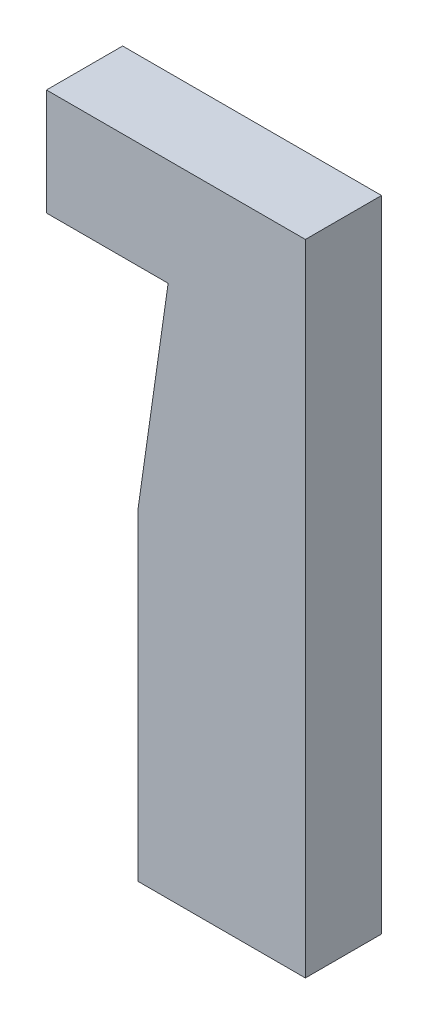
ISO-10303-21;
HEADER;
FILE_DESCRIPTION(('STEP AP214'),'2;1');
FILE_NAME('part.step','',(''),(''),'','','');
FILE_SCHEMA(('AUTOMOTIVE_DESIGN { 1 0 10303 214 1 1 1 1 }'));
ENDSEC;
DATA;
#1=APPLICATION_CONTEXT('core data for automotive mechanical design processes');
#2=APPLICATION_PROTOCOL_DEFINITION('international standard','automotive_design',2000,#1);
#3=PRODUCT_CONTEXT('',#1,'mechanical');
#4=PRODUCT('Part','Part','',(#3));
#5=PRODUCT_RELATED_PRODUCT_CATEGORY('part','',(#4));
#6=PRODUCT_DEFINITION_FORMATION('','',#4);
#7=PRODUCT_DEFINITION_CONTEXT('part definition',#1,'design');
#8=PRODUCT_DEFINITION('design','',#6,#7);
#9=PRODUCT_DEFINITION_SHAPE('','',#8);
#10=(LENGTH_UNIT() NAMED_UNIT(*) SI_UNIT(.MILLI.,.METRE.));
#11=(NAMED_UNIT(*) PLANE_ANGLE_UNIT() SI_UNIT($,.RADIAN.));
#12=(NAMED_UNIT(*) SI_UNIT($,.STERADIAN.) SOLID_ANGLE_UNIT());
#13=UNCERTAINTY_MEASURE_WITH_UNIT(LENGTH_MEASURE(1.E-05),#10,'distance_accuracy_value','');
#14=(GEOMETRIC_REPRESENTATION_CONTEXT(3) GLOBAL_UNCERTAINTY_ASSIGNED_CONTEXT((#13)) GLOBAL_UNIT_ASSIGNED_CONTEXT((#10,
#11,#12)) REPRESENTATION_CONTEXT('',''));
#15=CARTESIAN_POINT('',(0.,0.,0.));
#16=DIRECTION('',(0.,0.,1.));
#17=DIRECTION('',(1.,0.,0.));
#18=AXIS2_PLACEMENT_3D('',#15,#16,#17);
#19=CARTESIAN_POINT('',(0.,53.34,6.35));
#20=DIRECTION('',(0.,-1.,0.));
#21=DIRECTION('',(0.,0.,-1.));
#22=AXIS2_PLACEMENT_3D('',#19,#20,#21);
#23=PLANE('',#22);
#24=DIRECTION('',(-1.,0.,0.));
#25=VECTOR('',#24,1.);
#26=CARTESIAN_POINT('',(0.,53.34,0.));
#27=LINE('',#26,#25);
#28=CARTESIAN_POINT('',(0.,53.34,0.));
#29=VERTEX_POINT('',#28);
#30=CARTESIAN_POINT('',(-21.59,53.34,0.));
#31=VERTEX_POINT('',#30);
#32=EDGE_CURVE('E229',#29,#31,#27,.T.);
#33=ORIENTED_EDGE('',*,*,#32,.T.);
#34=DIRECTION('',(0.,0.,-1.));
#35=VECTOR('',#34,1.);
#36=CARTESIAN_POINT('',(-21.59,53.34,6.35));
#37=LINE('',#36,#35);
#38=CARTESIAN_POINT('',(-21.59,53.34,6.35));
#39=VERTEX_POINT('',#38);
#40=EDGE_CURVE('E281',#39,#31,#37,.T.);
#41=ORIENTED_EDGE('',*,*,#40,.F.);
#42=DIRECTION('',(-1.,0.,0.));
#43=VECTOR('',#42,1.);
#44=CARTESIAN_POINT('',(0.,53.34,6.35));
#45=LINE('',#44,#43);
#46=CARTESIAN_POINT('',(0.,53.34,6.35));
#47=VERTEX_POINT('',#46);
#48=EDGE_CURVE('E234',#47,#39,#45,.T.);
#49=ORIENTED_EDGE('',*,*,#48,.F.);
#50=DIRECTION('',(0.,0.,-1.));
#51=VECTOR('',#50,1.);
#52=CARTESIAN_POINT('',(0.,53.34,6.35));
#53=LINE('',#52,#51);
#54=EDGE_CURVE('E249',#47,#29,#53,.T.);
#55=ORIENTED_EDGE('',*,*,#54,.T.);
#56=EDGE_LOOP('',(#33,#41,#49,#55));
#57=FACE_BOUND('',#56,.T.);
#58=ADVANCED_FACE('F41',(#57),#23,.F.);
#59=CARTESIAN_POINT('',(-21.59,0.,6.35));
#60=DIRECTION('',(1.,0.,0.));
#61=DIRECTION('',(0.,0.,-1.));
#62=AXIS2_PLACEMENT_3D('',#59,#60,#61);
#63=PLANE('',#62);
#64=DIRECTION('',(0.,-1.,0.));
#65=VECTOR('',#64,1.);
#66=CARTESIAN_POINT('',(-21.59,0.,0.));
#67=LINE('',#66,#65);
#68=CARTESIAN_POINT('',(-21.59,44.45,0.));
#69=VERTEX_POINT('',#68);
#70=EDGE_CURVE('E253',#31,#69,#67,.T.);
#71=ORIENTED_EDGE('',*,*,#70,.T.);
#72=DIRECTION('',(0.,0.,-1.));
#73=VECTOR('',#72,1.);
#74=CARTESIAN_POINT('',(-21.59,44.45,6.35));
#75=LINE('',#74,#73);
#76=CARTESIAN_POINT('',(-21.59,44.45,6.35));
#77=VERTEX_POINT('',#76);
#78=EDGE_CURVE('E278',#77,#69,#75,.T.);
#79=ORIENTED_EDGE('',*,*,#78,.F.);
#80=DIRECTION('',(0.,-1.,0.));
#81=VECTOR('',#80,1.);
#82=CARTESIAN_POINT('',(-21.59,0.,6.35));
#83=LINE('',#82,#81);
#84=EDGE_CURVE('E156',#39,#77,#83,.T.);
#85=ORIENTED_EDGE('',*,*,#84,.F.);
#86=ORIENTED_EDGE('',*,*,#40,.T.);
#87=EDGE_LOOP('',(#71,#79,#85,#86));
#88=FACE_BOUND('',#87,.T.);
#89=ADVANCED_FACE('F346',(#88),#63,.F.);
#90=CARTESIAN_POINT('',(0.,44.45,6.35));
#91=DIRECTION('',(0.,-1.,0.));
#92=DIRECTION('',(0.,0.,-1.));
#93=AXIS2_PLACEMENT_3D('',#90,#91,#92);
#94=PLANE('',#93);
#95=DIRECTION('',(-1.,0.,0.));
#96=VECTOR('',#95,1.);
#97=CARTESIAN_POINT('',(0.,44.45,0.));
#98=LINE('',#97,#96);
#99=CARTESIAN_POINT('',(-11.4443077795451,44.45,0.));
#100=VERTEX_POINT('',#99);
#101=EDGE_CURVE('E166',#100,#69,#98,.T.);
#102=ORIENTED_EDGE('',*,*,#101,.F.);
#103=DIRECTION('',(0.,0.,-1.));
#104=VECTOR('',#103,1.);
#105=CARTESIAN_POINT('',(-11.4443077795451,44.45,6.35));
#106=LINE('',#105,#104);
#107=CARTESIAN_POINT('',(-11.4443077795451,44.45,6.35));
#108=VERTEX_POINT('',#107);
#109=EDGE_CURVE('E163',#108,#100,#106,.T.);
#110=ORIENTED_EDGE('',*,*,#109,.F.);
#111=DIRECTION('',(-1.,0.,0.));
#112=VECTOR('',#111,1.);
#113=CARTESIAN_POINT('',(0.,44.45,6.35));
#114=LINE('',#113,#112);
#115=EDGE_CURVE('E148',#108,#77,#114,.T.);
#116=ORIENTED_EDGE('',*,*,#115,.T.);
#117=ORIENTED_EDGE('',*,*,#78,.T.);
#118=EDGE_LOOP('',(#102,#110,#116,#117));
#119=FACE_BOUND('',#118,.T.);
#120=ADVANCED_FACE('F164',(#119),#94,.T.);
#121=CARTESIAN_POINT('',(-13.97,0.,6.35));
#122=DIRECTION('',(-1.,0.,0.));
#123=DIRECTION('',(0.,0.,1.));
#124=AXIS2_PLACEMENT_3D('',#121,#122,#123);
#125=PLANE('',#124);
#126=DIRECTION('',(0.,0.,-1.));
#127=VECTOR('',#126,1.);
#128=CARTESIAN_POINT('',(-13.97,26.7917452086647,6.35));
#129=LINE('',#128,#127);
#130=CARTESIAN_POINT('',(-13.97,26.7917452086647,6.35));
#131=VERTEX_POINT('',#130);
#132=CARTESIAN_POINT('',(-13.97,26.7917452086647,0.));
#133=VERTEX_POINT('',#132);
#134=EDGE_CURVE('E170',#131,#133,#129,.T.);
#135=ORIENTED_EDGE('',*,*,#134,.T.);
#136=DIRECTION('',(0.,1.,0.));
#137=VECTOR('',#136,1.);
#138=CARTESIAN_POINT('',(-13.97,0.,0.));
#139=LINE('',#138,#137);
#140=CARTESIAN_POINT('',(-13.97,0.,0.));
#141=VERTEX_POINT('',#140);
#142=EDGE_CURVE('E259',#141,#133,#139,.T.);
#143=ORIENTED_EDGE('',*,*,#142,.F.);
#144=DIRECTION('',(0.,0.,-1.));
#145=VECTOR('',#144,1.);
#146=CARTESIAN_POINT('',(-13.97,0.,6.35));
#147=LINE('',#146,#145);
#148=CARTESIAN_POINT('',(-13.97,0.,6.35));
#149=VERTEX_POINT('',#148);
#150=EDGE_CURVE('E275',#149,#141,#147,.T.);
#151=ORIENTED_EDGE('',*,*,#150,.F.);
#152=DIRECTION('',(0.,1.,0.));
#153=VECTOR('',#152,1.);
#154=CARTESIAN_POINT('',(-13.97,0.,6.35));
#155=LINE('',#154,#153);
#156=EDGE_CURVE('E160',#149,#131,#155,.T.);
#157=ORIENTED_EDGE('',*,*,#156,.T.);
#158=EDGE_LOOP('',(#135,#143,#151,#157));
#159=FACE_BOUND('',#158,.T.);
#160=ADVANCED_FACE('F366',(#159),#125,.T.);
#161=CARTESIAN_POINT('',(0.,0.,6.35));
#162=DIRECTION('',(0.,-1.,0.));
#163=DIRECTION('',(1.,0.,0.));
#164=AXIS2_PLACEMENT_3D('',#161,#162,#163);
#165=PLANE('',#164);
#166=DIRECTION('',(-1.,0.,0.));
#167=VECTOR('',#166,1.);
#168=CARTESIAN_POINT('',(0.,0.,0.));
#169=LINE('',#168,#167);
#170=CARTESIAN_POINT('',(0.,0.,0.));
#171=VERTEX_POINT('',#170);
#172=EDGE_CURVE('E263',#171,#141,#169,.T.);
#173=ORIENTED_EDGE('',*,*,#172,.F.);
#174=DIRECTION('',(0.,0.,-1.));
#175=VECTOR('',#174,1.);
#176=CARTESIAN_POINT('',(0.,0.,6.35));
#177=LINE('',#176,#175);
#178=CARTESIAN_POINT('',(0.,0.,6.35));
#179=VERTEX_POINT('',#178);
#180=EDGE_CURVE('E272',#179,#171,#177,.T.);
#181=ORIENTED_EDGE('',*,*,#180,.F.);
#182=DIRECTION('',(-1.,0.,0.));
#183=VECTOR('',#182,1.);
#184=CARTESIAN_POINT('',(0.,0.,6.35));
#185=LINE('',#184,#183);
#186=EDGE_CURVE('E242',#179,#149,#185,.T.);
#187=ORIENTED_EDGE('',*,*,#186,.T.);
#188=ORIENTED_EDGE('',*,*,#150,.T.);
#189=EDGE_LOOP('',(#173,#181,#187,#188));
#190=FACE_BOUND('',#189,.T.);
#191=ADVANCED_FACE('F363',(#190),#165,.T.);
#192=CARTESIAN_POINT('',(0.,0.,6.35));
#193=DIRECTION('',(-1.,0.,0.));
#194=DIRECTION('',(0.,-1.,0.));
#195=AXIS2_PLACEMENT_3D('',#192,#193,#194);
#196=PLANE('',#195);
#197=DIRECTION('',(0.,1.,0.));
#198=VECTOR('',#197,1.);
#199=CARTESIAN_POINT('',(0.,0.,0.));
#200=LINE('',#199,#198);
#201=EDGE_CURVE('E237',#171,#29,#200,.T.);
#202=ORIENTED_EDGE('',*,*,#201,.T.);
#203=ORIENTED_EDGE('',*,*,#54,.F.);
#204=DIRECTION('',(0.,1.,0.));
#205=VECTOR('',#204,1.);
#206=CARTESIAN_POINT('',(0.,0.,6.35));
#207=LINE('',#206,#205);
#208=EDGE_CURVE('E246',#179,#47,#207,.T.);
#209=ORIENTED_EDGE('',*,*,#208,.F.);
#210=ORIENTED_EDGE('',*,*,#180,.T.);
#211=EDGE_LOOP('',(#202,#203,#209,#210));
#212=FACE_BOUND('',#211,.T.);
#213=ADVANCED_FACE('F361',(#212),#196,.F.);
#214=CARTESIAN_POINT('',(0.,0.,6.35));
#215=DIRECTION('',(0.,0.,1.));
#216=DIRECTION('',(1.,0.,0.));
#217=AXIS2_PLACEMENT_3D('',#214,#215,#216);
#218=PLANE('',#217);
#219=DIRECTION('',(-0.141590807622745,-0.989925271521411,0.));
#220=VECTOR('',#219,1.);
#221=CARTESIAN_POINT('',(-11.4443077795451,44.45,6.35));
#222=LINE('',#221,#220);
#223=EDGE_CURVE('E153',#108,#131,#222,.T.);
#224=ORIENTED_EDGE('',*,*,#223,.T.);
#225=ORIENTED_EDGE('',*,*,#156,.F.);
#226=ORIENTED_EDGE('',*,*,#186,.F.);
#227=ORIENTED_EDGE('',*,*,#208,.T.);
#228=ORIENTED_EDGE('',*,*,#48,.T.);
#229=ORIENTED_EDGE('',*,*,#84,.T.);
#230=ORIENTED_EDGE('',*,*,#115,.F.);
#231=EDGE_LOOP('',(#224,#225,#226,#227,#228,#229,#230));
#232=FACE_BOUND('',#231,.T.);
#233=ADVANCED_FACE('F150',(#232),#218,.T.);
#234=CARTESIAN_POINT('',(0.,0.,0.));
#235=DIRECTION('',(0.,0.,1.));
#236=DIRECTION('',(1.,0.,0.));
#237=AXIS2_PLACEMENT_3D('',#234,#235,#236);
#238=PLANE('',#237);
#239=CARTESIAN_POINT('',(-6.985,15.24,0.));
#240=DIRECTION('',(0.,0.,-1.));
#241=DIRECTION('',(-1.,0.,0.));
#242=AXIS2_PLACEMENT_3D('',#239,#240,#241);
#243=CIRCLE('',#242,4.0005);
#244=CARTESIAN_POINT('',(-9.017,11.7939912579914,0.));
#245=VERTEX_POINT('',#244);
#246=CARTESIAN_POINT('',(-9.017,18.6860087420086,0.));
#247=VERTEX_POINT('',#246);
#248=EDGE_CURVE('E214',#245,#247,#243,.T.);
#249=ORIENTED_EDGE('',*,*,#248,.F.);
#250=DIRECTION('',(0.,1.,0.));
#251=VECTOR('',#250,1.);
#252=CARTESIAN_POINT('',(-9.017,15.24,0.));
#253=LINE('',#252,#251);
#254=CARTESIAN_POINT('',(-9.017,0.762000000000001,0.));
#255=VERTEX_POINT('',#254);
#256=EDGE_CURVE('E208',#255,#245,#253,.T.);
#257=ORIENTED_EDGE('',*,*,#256,.F.);
#258=DIRECTION('',(-1.,0.,0.));
#259=VECTOR('',#258,1.);
#260=CARTESIAN_POINT('',(-4.953,0.762000000000001,0.));
#261=LINE('',#260,#259);
#262=CARTESIAN_POINT('',(-4.953,0.762000000000001,0.));
#263=VERTEX_POINT('',#262);
#264=EDGE_CURVE('E203',#263,#255,#261,.T.);
#265=ORIENTED_EDGE('',*,*,#264,.F.);
#266=DIRECTION('',(0.,-1.,0.));
#267=VECTOR('',#266,1.);
#268=CARTESIAN_POINT('',(-4.953,15.24,0.));
#269=LINE('',#268,#267);
#270=CARTESIAN_POINT('',(-4.953,11.7939912579913,0.));
#271=VERTEX_POINT('',#270);
#272=EDGE_CURVE('E199',#271,#263,#269,.T.);
#273=ORIENTED_EDGE('',*,*,#272,.F.);
#274=CARTESIAN_POINT('',(-4.953,18.6860087420086,0.));
#275=VERTEX_POINT('',#274);
#276=EDGE_CURVE('E230',#275,#271,#243,.T.);
#277=ORIENTED_EDGE('',*,*,#276,.F.);
#278=CARTESIAN_POINT('',(-4.953,29.718,0.));
#279=VERTEX_POINT('',#278);
#280=EDGE_CURVE('E200',#279,#275,#269,.T.);
#281=ORIENTED_EDGE('',*,*,#280,.F.);
#282=DIRECTION('',(1.,0.,0.));
#283=VECTOR('',#282,1.);
#284=CARTESIAN_POINT('',(-6.985,29.718,0.));
#285=LINE('',#284,#283);
#286=CARTESIAN_POINT('',(-9.017,29.718,0.));
#287=VERTEX_POINT('',#286);
#288=EDGE_CURVE('E181',#287,#279,#285,.T.);
#289=ORIENTED_EDGE('',*,*,#288,.F.);
#290=EDGE_CURVE('E207',#247,#287,#253,.T.);
#291=ORIENTED_EDGE('',*,*,#290,.F.);
#292=EDGE_LOOP('',(#249,#257,#265,#273,#277,#281,#289,#291));
#293=FACE_BOUND('',#292,.T.);
#294=ORIENTED_EDGE('',*,*,#142,.T.);
#295=DIRECTION('',(-0.141590807622745,-0.989925271521411,0.));
#296=VECTOR('',#295,1.);
#297=CARTESIAN_POINT('',(-11.4443077795451,44.45,0.));
#298=LINE('',#297,#296);
#299=EDGE_CURVE('E175',#100,#133,#298,.T.);
#300=ORIENTED_EDGE('',*,*,#299,.F.);
#301=ORIENTED_EDGE('',*,*,#101,.T.);
#302=ORIENTED_EDGE('',*,*,#70,.F.);
#303=ORIENTED_EDGE('',*,*,#32,.F.);
#304=ORIENTED_EDGE('',*,*,#201,.F.);
#305=ORIENTED_EDGE('',*,*,#172,.T.);
#306=EDGE_LOOP('',(#294,#300,#301,#302,#303,#304,#305));
#307=FACE_BOUND('',#306,.T.);
#308=ADVANCED_FACE('F324',(#293,#307),#238,.F.);
#309=CARTESIAN_POINT('',(-6.985,15.24,2.794));
#310=DIRECTION('',(0.,0.,-1.));
#311=DIRECTION('',(-1.,0.,0.));
#312=AXIS2_PLACEMENT_3D('',#309,#310,#311);
#313=CYLINDRICAL_SURFACE('',#312,4.0005);
#314=CARTESIAN_POINT('',(-6.985,15.24,1.5875));
#315=DIRECTION('',(0.,0.,1.));
#316=DIRECTION('',(1.,0.,0.));
#317=AXIS2_PLACEMENT_3D('',#314,#315,#316);
#318=CIRCLE('',#317,4.0005);
#319=CARTESIAN_POINT('',(-4.953,11.7939912579913,1.5875));
#320=VERTEX_POINT('',#319);
#321=CARTESIAN_POINT('',(-9.017,11.7939912579914,1.5875));
#322=VERTEX_POINT('',#321);
#323=EDGE_CURVE('E290',#320,#322,#318,.F.);
#324=ORIENTED_EDGE('',*,*,#323,.T.);
#325=DIRECTION('',(0.,0.,-1.));
#326=VECTOR('',#325,1.);
#327=CARTESIAN_POINT('',(-9.017,11.7939912579914,2.794));
#328=LINE('',#327,#326);
#329=EDGE_CURVE('E11',#322,#245,#328,.T.);
#330=ORIENTED_EDGE('',*,*,#329,.T.);
#331=ORIENTED_EDGE('',*,*,#248,.T.);
#332=DIRECTION('',(0.,0.,-1.));
#333=VECTOR('',#332,1.);
#334=CARTESIAN_POINT('',(-9.017,18.6860087420086,2.794));
#335=LINE('',#334,#333);
#336=CARTESIAN_POINT('',(-9.017,18.6860087420086,1.5875));
#337=VERTEX_POINT('',#336);
#338=EDGE_CURVE('E294',#247,#337,#335,.F.);
#339=ORIENTED_EDGE('',*,*,#338,.T.);
#340=CARTESIAN_POINT('',(-4.953,18.6860087420086,1.5875));
#341=VERTEX_POINT('',#340);
#342=EDGE_CURVE('E285',#337,#341,#318,.F.);
#343=ORIENTED_EDGE('',*,*,#342,.T.);
#344=DIRECTION('',(0.,0.,-1.));
#345=VECTOR('',#344,1.);
#346=CARTESIAN_POINT('',(-4.953,18.6860087420086,2.794));
#347=LINE('',#346,#345);
#348=EDGE_CURVE('E289',#341,#275,#347,.T.);
#349=ORIENTED_EDGE('',*,*,#348,.T.);
#350=ORIENTED_EDGE('',*,*,#276,.T.);
#351=DIRECTION('',(0.,0.,-1.));
#352=VECTOR('',#351,1.);
#353=CARTESIAN_POINT('',(-4.953,11.7939912579913,2.794));
#354=LINE('',#353,#352);
#355=EDGE_CURVE('E49',#271,#320,#354,.F.);
#356=ORIENTED_EDGE('',*,*,#355,.T.);
#357=EDGE_LOOP('',(#324,#330,#331,#339,#343,#349,#350,#356));
#358=FACE_BOUND('',#357,.T.);
#359=CARTESIAN_POINT('',(-6.985,15.24,2.794));
#360=DIRECTION('',(0.,0.,-1.));
#361=DIRECTION('',(-1.,0.,0.));
#362=AXIS2_PLACEMENT_3D('',#359,#360,#361);
#363=CIRCLE('',#362,4.0005);
#364=CARTESIAN_POINT('',(-10.9855,15.24,2.794));
#365=VERTEX_POINT('',#364);
#366=EDGE_CURVE('E225',#365,#365,#363,.T.);
#367=ORIENTED_EDGE('',*,*,#366,.F.);
#368=EDGE_LOOP('',(#367));
#369=FACE_BOUND('',#368,.T.);
#370=ADVANCED_FACE('F303',(#358,#369),#313,.F.);
#371=CARTESIAN_POINT('',(-6.985,15.24,2.794));
#372=DIRECTION('',(0.,0.,-1.));
#373=DIRECTION('',(-1.,0.,0.));
#374=AXIS2_PLACEMENT_3D('',#371,#372,#373);
#375=PLANE('',#374);
#376=ORIENTED_EDGE('',*,*,#366,.T.);
#377=EDGE_LOOP('',(#376));
#378=FACE_BOUND('',#377,.T.);
#379=ADVANCED_FACE('F384',(#378),#375,.T.);
#380=CARTESIAN_POINT('',(0.,0.,1.5875));
#381=DIRECTION('',(0.,0.,1.));
#382=DIRECTION('',(1.,0.,0.));
#383=AXIS2_PLACEMENT_3D('',#380,#381,#382);
#384=PLANE('',#383);
#385=DIRECTION('',(0.,1.,0.));
#386=VECTOR('',#385,1.);
#387=CARTESIAN_POINT('',(-9.017,15.24,1.5875));
#388=LINE('',#387,#386);
#389=CARTESIAN_POINT('',(-9.017,29.718,1.5875));
#390=VERTEX_POINT('',#389);
#391=EDGE_CURVE('E186',#337,#390,#388,.T.);
#392=ORIENTED_EDGE('',*,*,#391,.T.);
#393=DIRECTION('',(1.,0.,0.));
#394=VECTOR('',#393,1.);
#395=CARTESIAN_POINT('',(-6.985,29.718,1.5875));
#396=LINE('',#395,#394);
#397=CARTESIAN_POINT('',(-4.953,29.718,1.5875));
#398=VERTEX_POINT('',#397);
#399=EDGE_CURVE('E185',#390,#398,#396,.T.);
#400=ORIENTED_EDGE('',*,*,#399,.T.);
#401=DIRECTION('',(0.,-1.,0.));
#402=VECTOR('',#401,1.);
#403=CARTESIAN_POINT('',(-4.953,15.24,1.5875));
#404=LINE('',#403,#402);
#405=EDGE_CURVE('E64',#398,#341,#404,.T.);
#406=ORIENTED_EDGE('',*,*,#405,.T.);
#407=ORIENTED_EDGE('',*,*,#342,.F.);
#408=EDGE_LOOP('',(#392,#400,#406,#407));
#409=FACE_BOUND('',#408,.T.);
#410=ADVANCED_FACE('F386',(#409),#384,.F.);
#411=CARTESIAN_POINT('',(-4.953,15.24,1.5875));
#412=DIRECTION('',(1.,0.,0.));
#413=DIRECTION('',(0.,1.,0.));
#414=AXIS2_PLACEMENT_3D('',#411,#412,#413);
#415=PLANE('',#414);
#416=ORIENTED_EDGE('',*,*,#405,.F.);
#417=DIRECTION('',(0.,0.,-1.));
#418=VECTOR('',#417,1.);
#419=CARTESIAN_POINT('',(-4.953,29.718,1.5875));
#420=LINE('',#419,#418);
#421=EDGE_CURVE('E219',#398,#279,#420,.T.);
#422=ORIENTED_EDGE('',*,*,#421,.T.);
#423=ORIENTED_EDGE('',*,*,#280,.T.);
#424=ORIENTED_EDGE('',*,*,#348,.F.);
#425=EDGE_LOOP('',(#416,#422,#423,#424));
#426=FACE_BOUND('',#425,.T.);
#427=ADVANCED_FACE('F338',(#426),#415,.F.);
#428=CARTESIAN_POINT('',(-9.017,15.24,1.5875));
#429=DIRECTION('',(-1.,0.,0.));
#430=DIRECTION('',(0.,-1.,0.));
#431=AXIS2_PLACEMENT_3D('',#428,#429,#430);
#432=PLANE('',#431);
#433=ORIENTED_EDGE('',*,*,#290,.T.);
#434=DIRECTION('',(0.,0.,-1.));
#435=VECTOR('',#434,1.);
#436=CARTESIAN_POINT('',(-9.017,29.718,1.5875));
#437=LINE('',#436,#435);
#438=EDGE_CURVE('E195',#390,#287,#437,.T.);
#439=ORIENTED_EDGE('',*,*,#438,.F.);
#440=ORIENTED_EDGE('',*,*,#391,.F.);
#441=ORIENTED_EDGE('',*,*,#338,.F.);
#442=EDGE_LOOP('',(#433,#439,#440,#441));
#443=FACE_BOUND('',#442,.T.);
#444=ADVANCED_FACE('F332',(#443),#432,.F.);
#445=CARTESIAN_POINT('',(-6.985,29.718,1.5875));
#446=DIRECTION('',(0.,1.,0.));
#447=DIRECTION('',(0.,0.,1.));
#448=AXIS2_PLACEMENT_3D('',#445,#446,#447);
#449=PLANE('',#448);
#450=ORIENTED_EDGE('',*,*,#288,.T.);
#451=ORIENTED_EDGE('',*,*,#421,.F.);
#452=ORIENTED_EDGE('',*,*,#399,.F.);
#453=ORIENTED_EDGE('',*,*,#438,.T.);
#454=EDGE_LOOP('',(#450,#451,#452,#453));
#455=FACE_BOUND('',#454,.T.);
#456=ADVANCED_FACE('F330',(#455),#449,.F.);
#457=CARTESIAN_POINT('',(-9.017,0.762000000000001,1.5875));
#458=VERTEX_POINT('',#457);
#459=EDGE_CURVE('E56',#458,#322,#388,.T.);
#460=ORIENTED_EDGE('',*,*,#459,.F.);
#461=DIRECTION('',(0.,0.,-1.));
#462=VECTOR('',#461,1.);
#463=CARTESIAN_POINT('',(-9.017,0.762000000000001,1.5875));
#464=LINE('',#463,#462);
#465=EDGE_CURVE('E211',#458,#255,#464,.T.);
#466=ORIENTED_EDGE('',*,*,#465,.T.);
#467=ORIENTED_EDGE('',*,*,#256,.T.);
#468=ORIENTED_EDGE('',*,*,#329,.F.);
#469=EDGE_LOOP('',(#460,#466,#467,#468));
#470=FACE_BOUND('',#469,.T.);
#471=ADVANCED_FACE('F328',(#470),#432,.F.);
#472=ORIENTED_EDGE('',*,*,#272,.T.);
#473=DIRECTION('',(0.,0.,-1.));
#474=VECTOR('',#473,1.);
#475=CARTESIAN_POINT('',(-4.953,0.762000000000001,1.5875));
#476=LINE('',#475,#474);
#477=CARTESIAN_POINT('',(-4.953,0.762000000000001,1.5875));
#478=VERTEX_POINT('',#477);
#479=EDGE_CURVE('E215',#478,#263,#476,.T.);
#480=ORIENTED_EDGE('',*,*,#479,.F.);
#481=EDGE_CURVE('E189',#320,#478,#404,.T.);
#482=ORIENTED_EDGE('',*,*,#481,.F.);
#483=ORIENTED_EDGE('',*,*,#355,.F.);
#484=EDGE_LOOP('',(#472,#480,#482,#483));
#485=FACE_BOUND('',#484,.T.);
#486=ADVANCED_FACE('F310',(#485),#415,.F.);
#487=ORIENTED_EDGE('',*,*,#481,.T.);
#488=DIRECTION('',(-1.,0.,0.));
#489=VECTOR('',#488,1.);
#490=CARTESIAN_POINT('',(-4.953,0.762000000000001,1.5875));
#491=LINE('',#490,#489);
#492=EDGE_CURVE('E192',#478,#458,#491,.T.);
#493=ORIENTED_EDGE('',*,*,#492,.T.);
#494=ORIENTED_EDGE('',*,*,#459,.T.);
#495=ORIENTED_EDGE('',*,*,#323,.F.);
#496=EDGE_LOOP('',(#487,#493,#494,#495));
#497=FACE_BOUND('',#496,.T.);
#498=ADVANCED_FACE('F307',(#497),#384,.F.);
#499=CARTESIAN_POINT('',(-4.953,0.762000000000001,1.5875));
#500=DIRECTION('',(0.,-1.,0.));
#501=DIRECTION('',(0.,0.,-1.));
#502=AXIS2_PLACEMENT_3D('',#499,#500,#501);
#503=PLANE('',#502);
#504=ORIENTED_EDGE('',*,*,#264,.T.);
#505=ORIENTED_EDGE('',*,*,#465,.F.);
#506=ORIENTED_EDGE('',*,*,#492,.F.);
#507=ORIENTED_EDGE('',*,*,#479,.T.);
#508=EDGE_LOOP('',(#504,#505,#506,#507));
#509=FACE_BOUND('',#508,.T.);
#510=ADVANCED_FACE('F321',(#509),#503,.F.);
#511=CARTESIAN_POINT('',(-11.4443077795451,44.45,6.35));
#512=DIRECTION('',(0.989925271521411,-0.141590807622745,0.));
#513=DIRECTION('',(0.141590807622745,0.989925271521411,0.));
#514=AXIS2_PLACEMENT_3D('',#511,#512,#513);
#515=PLANE('',#514);
#516=ORIENTED_EDGE('',*,*,#299,.T.);
#517=ORIENTED_EDGE('',*,*,#134,.F.);
#518=ORIENTED_EDGE('',*,*,#223,.F.);
#519=ORIENTED_EDGE('',*,*,#109,.T.);
#520=EDGE_LOOP('',(#516,#517,#518,#519));
#521=FACE_BOUND('',#520,.T.);
#522=ADVANCED_FACE('F172',(#521),#515,.F.);
#523=CLOSED_SHELL('',(#58,#89,#120,#160,#191,#213,#233,#308,#370,#379,#410,#427,#444,#456,#471,
#486,#498,#510,#522));
#524=MANIFOLD_SOLID_BREP('B2',#523);
#525=ADVANCED_BREP_SHAPE_REPRESENTATION('',(#18,#524),#14);
#526=SHAPE_DEFINITION_REPRESENTATION(#9,#525);
ENDSEC;
END-ISO-10303-21;
